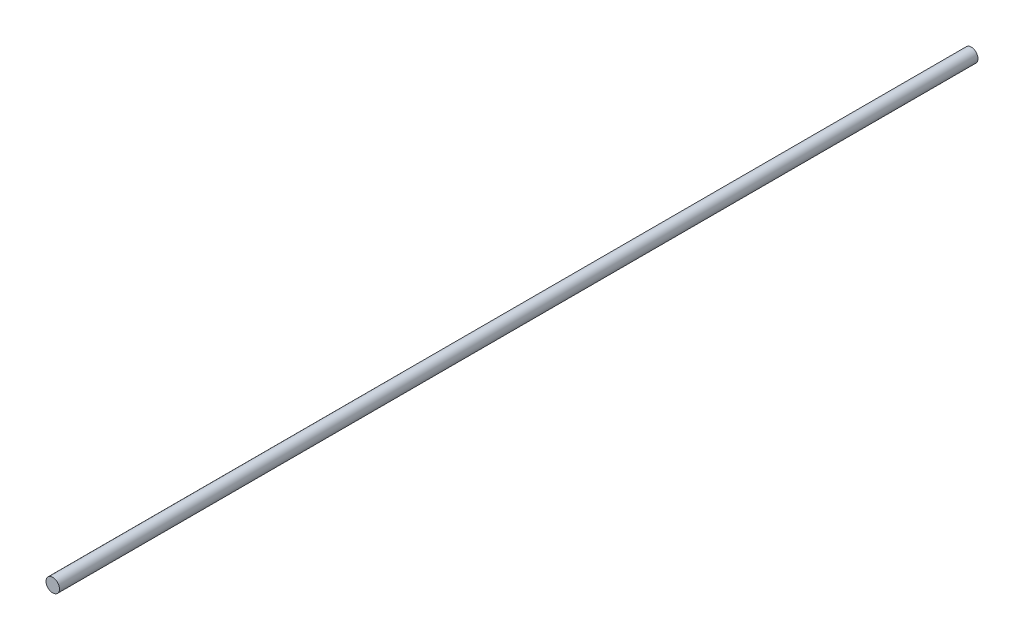
ISO-10303-21;
HEADER;
FILE_DESCRIPTION(('STEP AP214'),'2;1');
FILE_NAME('part.step','',(''),(''),'','','');
FILE_SCHEMA(('AUTOMOTIVE_DESIGN { 1 0 10303 214 1 1 1 1 }'));
ENDSEC;
DATA;
#1=APPLICATION_CONTEXT('core data for automotive mechanical design processes');
#2=APPLICATION_PROTOCOL_DEFINITION('international standard','automotive_design',2000,#1);
#3=PRODUCT_CONTEXT('',#1,'mechanical');
#4=PRODUCT('Part','Part','',(#3));
#5=PRODUCT_RELATED_PRODUCT_CATEGORY('part','',(#4));
#6=PRODUCT_DEFINITION_FORMATION('','',#4);
#7=PRODUCT_DEFINITION_CONTEXT('part definition',#1,'design');
#8=PRODUCT_DEFINITION('design','',#6,#7);
#9=PRODUCT_DEFINITION_SHAPE('','',#8);
#10=(LENGTH_UNIT() NAMED_UNIT(*) SI_UNIT(.MILLI.,.METRE.));
#11=(NAMED_UNIT(*) PLANE_ANGLE_UNIT() SI_UNIT($,.RADIAN.));
#12=(NAMED_UNIT(*) SI_UNIT($,.STERADIAN.) SOLID_ANGLE_UNIT());
#13=UNCERTAINTY_MEASURE_WITH_UNIT(LENGTH_MEASURE(1.E-05),#10,'distance_accuracy_value','');
#14=(GEOMETRIC_REPRESENTATION_CONTEXT(3) GLOBAL_UNCERTAINTY_ASSIGNED_CONTEXT((#13)) GLOBAL_UNIT_ASSIGNED_CONTEXT((#10,
#11,#12)) REPRESENTATION_CONTEXT('',''));
#15=CARTESIAN_POINT('',(0.,0.,0.));
#16=DIRECTION('',(0.,0.,1.));
#17=DIRECTION('',(1.,0.,0.));
#18=AXIS2_PLACEMENT_3D('',#15,#16,#17);
#19=CARTESIAN_POINT('',(0.,0.,215.9));
#20=DIRECTION('',(0.,0.,-1.));
#21=DIRECTION('',(-1.,0.,0.));
#22=AXIS2_PLACEMENT_3D('',#19,#20,#21);
#23=CYLINDRICAL_SURFACE('',#22,1.5875);
#24=CARTESIAN_POINT('',(0.,0.,215.9));
#25=DIRECTION('',(0.,0.,1.));
#26=DIRECTION('',(1.,0.,0.));
#27=AXIS2_PLACEMENT_3D('',#24,#25,#26);
#28=CIRCLE('',#27,1.5875);
#29=CARTESIAN_POINT('',(1.5875,0.,215.9));
#30=VERTEX_POINT('',#29);
#31=EDGE_CURVE('E10',#30,#30,#28,.T.);
#32=ORIENTED_EDGE('',*,*,#31,.F.);
#33=EDGE_LOOP('',(#32));
#34=FACE_BOUND('',#33,.T.);
#35=CARTESIAN_POINT('',(0.,0.,0.));
#36=DIRECTION('',(0.,0.,1.));
#37=DIRECTION('',(1.,0.,0.));
#38=AXIS2_PLACEMENT_3D('',#35,#36,#37);
#39=CIRCLE('',#38,1.5875);
#40=CARTESIAN_POINT('',(1.5875,0.,0.));
#41=VERTEX_POINT('',#40);
#42=EDGE_CURVE('E40',#41,#41,#39,.T.);
#43=ORIENTED_EDGE('',*,*,#42,.T.);
#44=EDGE_LOOP('',(#43));
#45=FACE_BOUND('',#44,.T.);
#46=ADVANCED_FACE('F37',(#34,#45),#23,.T.);
#47=CARTESIAN_POINT('',(0.,0.,215.9));
#48=DIRECTION('',(0.,0.,1.));
#49=DIRECTION('',(1.,0.,0.));
#50=AXIS2_PLACEMENT_3D('',#47,#48,#49);
#51=PLANE('',#50);
#52=ORIENTED_EDGE('',*,*,#31,.T.);
#53=EDGE_LOOP('',(#52));
#54=FACE_BOUND('',#53,.T.);
#55=ADVANCED_FACE('F54',(#54),#51,.T.);
#56=CARTESIAN_POINT('',(0.,0.,0.));
#57=DIRECTION('',(0.,0.,1.));
#58=DIRECTION('',(1.,0.,0.));
#59=AXIS2_PLACEMENT_3D('',#56,#57,#58);
#60=PLANE('',#59);
#61=ORIENTED_EDGE('',*,*,#42,.F.);
#62=EDGE_LOOP('',(#61));
#63=FACE_BOUND('',#62,.T.);
#64=ADVANCED_FACE('F52',(#63),#60,.F.);
#65=CLOSED_SHELL('',(#46,#55,#64));
#66=MANIFOLD_SOLID_BREP('B2',#65);
#67=ADVANCED_BREP_SHAPE_REPRESENTATION('',(#18,#66),#14);
#68=SHAPE_DEFINITION_REPRESENTATION(#9,#67);
ENDSEC;
END-ISO-10303-21;
